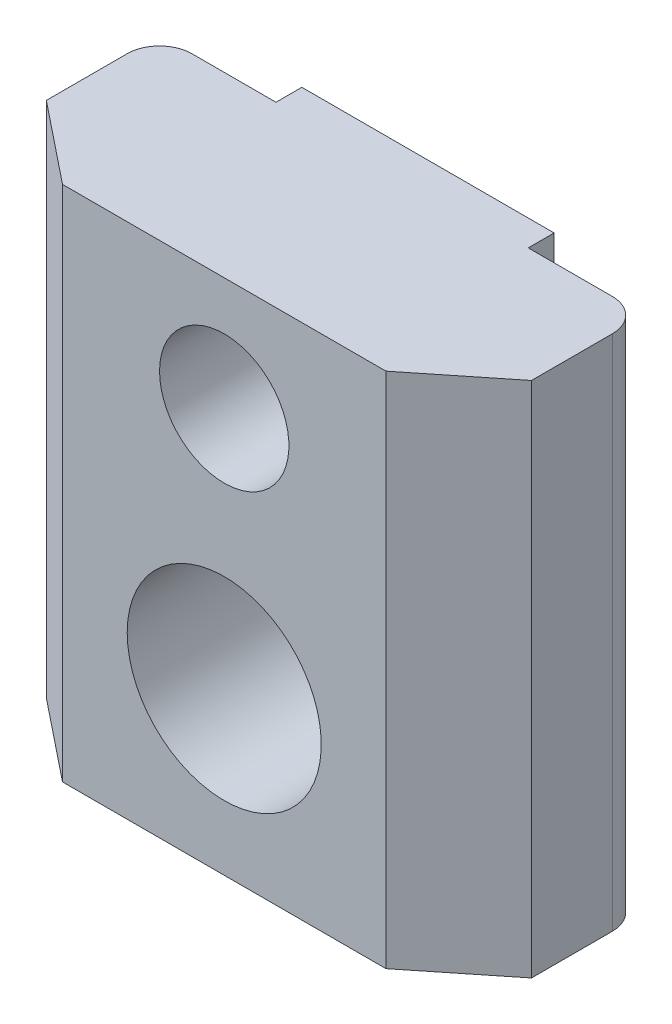
ISO-10303-21;
HEADER;
FILE_DESCRIPTION(('STEP AP214'),'2;1');
FILE_NAME('part.step','',(''),(''),'','','');
FILE_SCHEMA(('AUTOMOTIVE_DESIGN { 1 0 10303 214 1 1 1 1 }'));
ENDSEC;
DATA;
#1=APPLICATION_CONTEXT('core data for automotive mechanical design processes');
#2=APPLICATION_PROTOCOL_DEFINITION('international standard','automotive_design',2000,#1);
#3=PRODUCT_CONTEXT('',#1,'mechanical');
#4=PRODUCT('Part','Part','',(#3));
#5=PRODUCT_RELATED_PRODUCT_CATEGORY('part','',(#4));
#6=PRODUCT_DEFINITION_FORMATION('','',#4);
#7=PRODUCT_DEFINITION_CONTEXT('part definition',#1,'design');
#8=PRODUCT_DEFINITION('design','',#6,#7);
#9=PRODUCT_DEFINITION_SHAPE('','',#8);
#10=(LENGTH_UNIT() NAMED_UNIT(*) SI_UNIT(.MILLI.,.METRE.));
#11=(NAMED_UNIT(*) PLANE_ANGLE_UNIT() SI_UNIT($,.RADIAN.));
#12=(NAMED_UNIT(*) SI_UNIT($,.STERADIAN.) SOLID_ANGLE_UNIT());
#13=UNCERTAINTY_MEASURE_WITH_UNIT(LENGTH_MEASURE(1.E-05),#10,'distance_accuracy_value','');
#14=(GEOMETRIC_REPRESENTATION_CONTEXT(3) GLOBAL_UNCERTAINTY_ASSIGNED_CONTEXT((#13)) GLOBAL_UNIT_ASSIGNED_CONTEXT((#10,
#11,#12)) REPRESENTATION_CONTEXT('',''));
#15=CARTESIAN_POINT('',(0.,0.,0.));
#16=DIRECTION('',(0.,0.,1.));
#17=DIRECTION('',(1.,0.,0.));
#18=AXIS2_PLACEMENT_3D('',#15,#16,#17);
#19=CARTESIAN_POINT('',(3.9,-5.,-0.799999999999996));
#20=DIRECTION('',(1.,0.,0.));
#21=DIRECTION('',(0.,0.,-1.));
#22=AXIS2_PLACEMENT_3D('',#19,#20,#21);
#23=PLANE('',#22);
#24=DIRECTION('',(0.,1.,0.));
#25=VECTOR('',#24,1.);
#26=CARTESIAN_POINT('',(3.9,-5.,-0.799999999999996));
#27=LINE('',#26,#25);
#28=CARTESIAN_POINT('',(3.9,-5.,-0.799999999999996));
#29=VERTEX_POINT('',#28);
#30=CARTESIAN_POINT('',(3.9,11.,-0.799999999999996));
#31=VERTEX_POINT('',#30);
#32=EDGE_CURVE('E120',#29,#31,#27,.T.);
#33=ORIENTED_EDGE('',*,*,#32,.T.);
#34=DIRECTION('',(0.,0.,-1.));
#35=VECTOR('',#34,1.);
#36=CARTESIAN_POINT('',(3.9,11.,-0.799999999999996));
#37=LINE('',#36,#35);
#38=CARTESIAN_POINT('',(3.9,11.,0.));
#39=VERTEX_POINT('',#38);
#40=EDGE_CURVE('E124',#39,#31,#37,.T.);
#41=ORIENTED_EDGE('',*,*,#40,.F.);
#42=DIRECTION('',(0.,1.,0.));
#43=VECTOR('',#42,1.);
#44=CARTESIAN_POINT('',(3.9,-5.,0.));
#45=LINE('',#44,#43);
#46=CARTESIAN_POINT('',(3.9,-5.,0.));
#47=VERTEX_POINT('',#46);
#48=EDGE_CURVE('E194',#47,#39,#45,.T.);
#49=ORIENTED_EDGE('',*,*,#48,.F.);
#50=DIRECTION('',(0.,0.,-1.));
#51=VECTOR('',#50,1.);
#52=CARTESIAN_POINT('',(3.9,-5.,-0.799999999999996));
#53=LINE('',#52,#51);
#54=EDGE_CURVE('E126',#47,#29,#53,.T.);
#55=ORIENTED_EDGE('',*,*,#54,.T.);
#56=EDGE_LOOP('',(#33,#41,#49,#55));
#57=FACE_BOUND('',#56,.T.);
#58=ADVANCED_FACE('F31',(#57),#23,.T.);
#59=CARTESIAN_POINT('',(3.9,-5.,0.));
#60=DIRECTION('',(0.,0.,-1.));
#61=DIRECTION('',(-1.,0.,0.));
#62=AXIS2_PLACEMENT_3D('',#59,#60,#61);
#63=PLANE('',#62);
#64=DIRECTION('',(-1.,0.,0.));
#65=VECTOR('',#64,1.);
#66=CARTESIAN_POINT('',(3.9,11.,0.));
#67=LINE('',#66,#65);
#68=CARTESIAN_POINT('',(6.5,11.,0.));
#69=VERTEX_POINT('',#68);
#70=EDGE_CURVE('E144',#69,#39,#67,.T.);
#71=ORIENTED_EDGE('',*,*,#70,.F.);
#72=DIRECTION('',(0.,1.,0.));
#73=VECTOR('',#72,1.);
#74=CARTESIAN_POINT('',(6.5,-5.,0.));
#75=LINE('',#74,#73);
#76=CARTESIAN_POINT('',(6.5,-5.,0.));
#77=VERTEX_POINT('',#76);
#78=EDGE_CURVE('E215',#69,#77,#75,.F.);
#79=ORIENTED_EDGE('',*,*,#78,.T.);
#80=DIRECTION('',(-1.,0.,0.));
#81=VECTOR('',#80,1.);
#82=CARTESIAN_POINT('',(3.9,-5.,0.));
#83=LINE('',#82,#81);
#84=EDGE_CURVE('E131',#77,#47,#83,.T.);
#85=ORIENTED_EDGE('',*,*,#84,.T.);
#86=ORIENTED_EDGE('',*,*,#48,.T.);
#87=EDGE_LOOP('',(#71,#79,#85,#86));
#88=FACE_BOUND('',#87,.T.);
#89=ADVANCED_FACE('F260',(#88),#63,.T.);
#90=CARTESIAN_POINT('',(7.5,-5.,0.));
#91=DIRECTION('',(1.,0.,0.));
#92=DIRECTION('',(0.,0.,-1.));
#93=AXIS2_PLACEMENT_3D('',#90,#91,#92);
#94=PLANE('',#93);
#95=DIRECTION('',(0.,0.,-1.));
#96=VECTOR('',#95,1.);
#97=CARTESIAN_POINT('',(7.5,-5.,0.));
#98=LINE('',#97,#96);
#99=CARTESIAN_POINT('',(7.5,-5.,3.5));
#100=VERTEX_POINT('',#99);
#101=CARTESIAN_POINT('',(7.5,-5.,1.));
#102=VERTEX_POINT('',#101);
#103=EDGE_CURVE('E190',#100,#102,#98,.T.);
#104=ORIENTED_EDGE('',*,*,#103,.T.);
#105=DIRECTION('',(0.,1.,0.));
#106=VECTOR('',#105,1.);
#107=CARTESIAN_POINT('',(7.5,-5.,1.));
#108=LINE('',#107,#106);
#109=CARTESIAN_POINT('',(7.5,11.,1.));
#110=VERTEX_POINT('',#109);
#111=EDGE_CURVE('E196',#102,#110,#108,.T.);
#112=ORIENTED_EDGE('',*,*,#111,.T.);
#113=DIRECTION('',(0.,0.,-1.));
#114=VECTOR('',#113,1.);
#115=CARTESIAN_POINT('',(7.5,11.,0.));
#116=LINE('',#115,#114);
#117=CARTESIAN_POINT('',(7.5,11.,3.5));
#118=VERTEX_POINT('',#117);
#119=EDGE_CURVE('E168',#118,#110,#116,.T.);
#120=ORIENTED_EDGE('',*,*,#119,.F.);
#121=DIRECTION('',(0.,1.,0.));
#122=VECTOR('',#121,1.);
#123=CARTESIAN_POINT('',(7.5,-5.,3.5));
#124=LINE('',#123,#122);
#125=EDGE_CURVE('E197',#100,#118,#124,.T.);
#126=ORIENTED_EDGE('',*,*,#125,.F.);
#127=EDGE_LOOP('',(#104,#112,#120,#126));
#128=FACE_BOUND('',#127,.T.);
#129=ADVANCED_FACE('F239',(#128),#94,.T.);
#130=CARTESIAN_POINT('',(7.5,-5.,3.5));
#131=DIRECTION('',(0.624695047554424,0.,0.78086880944303));
#132=DIRECTION('',(0.78086880944303,0.,-0.624695047554424));
#133=AXIS2_PLACEMENT_3D('',#130,#131,#132);
#134=PLANE('',#133);
#135=ORIENTED_EDGE('',*,*,#125,.T.);
#136=DIRECTION('',(0.78086880944303,0.,-0.624695047554424));
#137=VECTOR('',#136,1.);
#138=CARTESIAN_POINT('',(7.5,11.,3.5));
#139=LINE('',#138,#137);
#140=CARTESIAN_POINT('',(5.,11.,5.5));
#141=VERTEX_POINT('',#140);
#142=EDGE_CURVE('E165',#141,#118,#139,.T.);
#143=ORIENTED_EDGE('',*,*,#142,.F.);
#144=DIRECTION('',(0.,1.,0.));
#145=VECTOR('',#144,1.);
#146=CARTESIAN_POINT('',(5.,-5.,5.5));
#147=LINE('',#146,#145);
#148=CARTESIAN_POINT('',(5.,-5.,5.5));
#149=VERTEX_POINT('',#148);
#150=EDGE_CURVE('E199',#149,#141,#147,.T.);
#151=ORIENTED_EDGE('',*,*,#150,.F.);
#152=DIRECTION('',(0.78086880944303,0.,-0.624695047554424));
#153=VECTOR('',#152,1.);
#154=CARTESIAN_POINT('',(7.5,-5.,3.5));
#155=LINE('',#154,#153);
#156=EDGE_CURVE('E187',#149,#100,#155,.T.);
#157=ORIENTED_EDGE('',*,*,#156,.T.);
#158=EDGE_LOOP('',(#135,#143,#151,#157));
#159=FACE_BOUND('',#158,.T.);
#160=ADVANCED_FACE('F243',(#159),#134,.T.);
#161=CARTESIAN_POINT('',(5.,-5.,5.5));
#162=DIRECTION('',(0.,0.,1.));
#163=DIRECTION('',(1.,0.,0.));
#164=AXIS2_PLACEMENT_3D('',#161,#162,#163);
#165=PLANE('',#164);
#166=CARTESIAN_POINT('',(0.,7.5,5.5));
#167=DIRECTION('',(0.,0.,-1.));
#168=DIRECTION('',(-1.,0.,0.));
#169=AXIS2_PLACEMENT_3D('',#166,#167,#168);
#170=CIRCLE('',#169,2.);
#171=CARTESIAN_POINT('',(-2.,7.5,5.5));
#172=VERTEX_POINT('',#171);
#173=EDGE_CURVE('E300',#172,#172,#170,.T.);
#174=ORIENTED_EDGE('',*,*,#173,.T.);
#175=EDGE_LOOP('',(#174));
#176=FACE_BOUND('',#175,.T.);
#177=CARTESIAN_POINT('',(0.,0.,5.5));
#178=DIRECTION('',(0.,0.,-1.));
#179=DIRECTION('',(-1.,0.,0.));
#180=AXIS2_PLACEMENT_3D('',#177,#178,#179);
#181=CIRCLE('',#180,3.);
#182=CARTESIAN_POINT('',(-3.,0.,5.5));
#183=VERTEX_POINT('',#182);
#184=EDGE_CURVE('E146',#183,#183,#181,.T.);
#185=ORIENTED_EDGE('',*,*,#184,.T.);
#186=EDGE_LOOP('',(#185));
#187=FACE_BOUND('',#186,.T.);
#188=ORIENTED_EDGE('',*,*,#150,.T.);
#189=DIRECTION('',(1.,0.,0.));
#190=VECTOR('',#189,1.);
#191=CARTESIAN_POINT('',(5.,11.,5.5));
#192=LINE('',#191,#190);
#193=CARTESIAN_POINT('',(-5.,11.,5.5));
#194=VERTEX_POINT('',#193);
#195=EDGE_CURVE('E162',#194,#141,#192,.T.);
#196=ORIENTED_EDGE('',*,*,#195,.F.);
#197=DIRECTION('',(0.,1.,0.));
#198=VECTOR('',#197,1.);
#199=CARTESIAN_POINT('',(-5.,-5.,5.5));
#200=LINE('',#199,#198);
#201=CARTESIAN_POINT('',(-5.,-5.,5.5));
#202=VERTEX_POINT('',#201);
#203=EDGE_CURVE('E201',#202,#194,#200,.T.);
#204=ORIENTED_EDGE('',*,*,#203,.F.);
#205=DIRECTION('',(1.,0.,0.));
#206=VECTOR('',#205,1.);
#207=CARTESIAN_POINT('',(5.,-5.,5.5));
#208=LINE('',#207,#206);
#209=EDGE_CURVE('E184',#202,#149,#208,.T.);
#210=ORIENTED_EDGE('',*,*,#209,.T.);
#211=EDGE_LOOP('',(#188,#196,#204,#210));
#212=FACE_BOUND('',#211,.T.);
#213=ADVANCED_FACE('F248',(#176,#187,#212),#165,.T.);
#214=CARTESIAN_POINT('',(-7.5,-5.,3.5));
#215=DIRECTION('',(-0.624695047554424,0.,0.78086880944303));
#216=DIRECTION('',(0.78086880944303,0.,0.624695047554424));
#217=AXIS2_PLACEMENT_3D('',#214,#215,#216);
#218=PLANE('',#217);
#219=ORIENTED_EDGE('',*,*,#203,.T.);
#220=DIRECTION('',(0.78086880944303,0.,0.624695047554424));
#221=VECTOR('',#220,1.);
#222=CARTESIAN_POINT('',(-7.5,11.,3.5));
#223=LINE('',#222,#221);
#224=CARTESIAN_POINT('',(-7.5,11.,3.5));
#225=VERTEX_POINT('',#224);
#226=EDGE_CURVE('E159',#225,#194,#223,.T.);
#227=ORIENTED_EDGE('',*,*,#226,.F.);
#228=DIRECTION('',(0.,1.,0.));
#229=VECTOR('',#228,1.);
#230=CARTESIAN_POINT('',(-7.5,-5.,3.5));
#231=LINE('',#230,#229);
#232=CARTESIAN_POINT('',(-7.5,-5.,3.5));
#233=VERTEX_POINT('',#232);
#234=EDGE_CURVE('E203',#233,#225,#231,.T.);
#235=ORIENTED_EDGE('',*,*,#234,.F.);
#236=DIRECTION('',(0.78086880944303,0.,0.624695047554424));
#237=VECTOR('',#236,1.);
#238=CARTESIAN_POINT('',(-7.5,-5.,3.5));
#239=LINE('',#238,#237);
#240=EDGE_CURVE('E181',#233,#202,#239,.T.);
#241=ORIENTED_EDGE('',*,*,#240,.T.);
#242=EDGE_LOOP('',(#219,#227,#235,#241));
#243=FACE_BOUND('',#242,.T.);
#244=ADVANCED_FACE('F251',(#243),#218,.T.);
#245=CARTESIAN_POINT('',(-7.5,-5.,0.));
#246=DIRECTION('',(-1.,0.,0.));
#247=DIRECTION('',(0.,0.,1.));
#248=AXIS2_PLACEMENT_3D('',#245,#246,#247);
#249=PLANE('',#248);
#250=DIRECTION('',(0.,0.,1.));
#251=VECTOR('',#250,1.);
#252=CARTESIAN_POINT('',(-7.5,11.,0.));
#253=LINE('',#252,#251);
#254=CARTESIAN_POINT('',(-7.5,11.,1.));
#255=VERTEX_POINT('',#254);
#256=EDGE_CURVE('E157',#255,#225,#253,.T.);
#257=ORIENTED_EDGE('',*,*,#256,.F.);
#258=DIRECTION('',(0.,1.,0.));
#259=VECTOR('',#258,1.);
#260=CARTESIAN_POINT('',(-7.5,-5.,1.));
#261=LINE('',#260,#259);
#262=CARTESIAN_POINT('',(-7.5,-5.,1.));
#263=VERTEX_POINT('',#262);
#264=EDGE_CURVE('E11',#255,#263,#261,.F.);
#265=ORIENTED_EDGE('',*,*,#264,.T.);
#266=DIRECTION('',(0.,0.,1.));
#267=VECTOR('',#266,1.);
#268=CARTESIAN_POINT('',(-7.5,-5.,0.));
#269=LINE('',#268,#267);
#270=EDGE_CURVE('E179',#263,#233,#269,.T.);
#271=ORIENTED_EDGE('',*,*,#270,.T.);
#272=ORIENTED_EDGE('',*,*,#234,.T.);
#273=EDGE_LOOP('',(#257,#265,#271,#272));
#274=FACE_BOUND('',#273,.T.);
#275=ADVANCED_FACE('F253',(#274),#249,.T.);
#276=CARTESIAN_POINT('',(-3.9,-5.,0.));
#277=DIRECTION('',(0.,0.,-1.));
#278=DIRECTION('',(-1.,0.,0.));
#279=AXIS2_PLACEMENT_3D('',#276,#277,#278);
#280=PLANE('',#279);
#281=DIRECTION('',(-1.,0.,0.));
#282=VECTOR('',#281,1.);
#283=CARTESIAN_POINT('',(-3.9,-5.,0.));
#284=LINE('',#283,#282);
#285=CARTESIAN_POINT('',(-3.9,-5.,0.));
#286=VERTEX_POINT('',#285);
#287=CARTESIAN_POINT('',(-6.5,-5.,0.));
#288=VERTEX_POINT('',#287);
#289=EDGE_CURVE('E177',#286,#288,#284,.T.);
#290=ORIENTED_EDGE('',*,*,#289,.T.);
#291=DIRECTION('',(0.,1.,0.));
#292=VECTOR('',#291,1.);
#293=CARTESIAN_POINT('',(-6.5,-5.,0.));
#294=LINE('',#293,#292);
#295=CARTESIAN_POINT('',(-6.5,11.,0.));
#296=VERTEX_POINT('',#295);
#297=EDGE_CURVE('E39',#288,#296,#294,.T.);
#298=ORIENTED_EDGE('',*,*,#297,.T.);
#299=DIRECTION('',(-1.,0.,0.));
#300=VECTOR('',#299,1.);
#301=CARTESIAN_POINT('',(-3.9,11.,0.));
#302=LINE('',#301,#300);
#303=CARTESIAN_POINT('',(-3.9,11.,0.));
#304=VERTEX_POINT('',#303);
#305=EDGE_CURVE('E154',#304,#296,#302,.T.);
#306=ORIENTED_EDGE('',*,*,#305,.F.);
#307=DIRECTION('',(0.,1.,0.));
#308=VECTOR('',#307,1.);
#309=CARTESIAN_POINT('',(-3.9,-5.,0.));
#310=LINE('',#309,#308);
#311=EDGE_CURVE('E206',#286,#304,#310,.T.);
#312=ORIENTED_EDGE('',*,*,#311,.F.);
#313=EDGE_LOOP('',(#290,#298,#306,#312));
#314=FACE_BOUND('',#313,.T.);
#315=ADVANCED_FACE('F223',(#314),#280,.T.);
#316=CARTESIAN_POINT('',(-3.9,-5.,-0.799999999999996));
#317=DIRECTION('',(-1.,0.,0.));
#318=DIRECTION('',(0.,0.,1.));
#319=AXIS2_PLACEMENT_3D('',#316,#317,#318);
#320=PLANE('',#319);
#321=ORIENTED_EDGE('',*,*,#311,.T.);
#322=DIRECTION('',(0.,0.,1.));
#323=VECTOR('',#322,1.);
#324=CARTESIAN_POINT('',(-3.9,11.,-0.799999999999996));
#325=LINE('',#324,#323);
#326=CARTESIAN_POINT('',(-3.9,11.,-0.799999999999996));
#327=VERTEX_POINT('',#326);
#328=EDGE_CURVE('E139',#327,#304,#325,.T.);
#329=ORIENTED_EDGE('',*,*,#328,.F.);
#330=DIRECTION('',(0.,1.,0.));
#331=VECTOR('',#330,1.);
#332=CARTESIAN_POINT('',(-3.9,-5.,-0.799999999999996));
#333=LINE('',#332,#331);
#334=CARTESIAN_POINT('',(-3.9,-5.,-0.799999999999996));
#335=VERTEX_POINT('',#334);
#336=EDGE_CURVE('E130',#335,#327,#333,.T.);
#337=ORIENTED_EDGE('',*,*,#336,.F.);
#338=DIRECTION('',(0.,0.,1.));
#339=VECTOR('',#338,1.);
#340=CARTESIAN_POINT('',(-3.9,-5.,-0.799999999999996));
#341=LINE('',#340,#339);
#342=EDGE_CURVE('E174',#335,#286,#341,.T.);
#343=ORIENTED_EDGE('',*,*,#342,.T.);
#344=EDGE_LOOP('',(#321,#329,#337,#343));
#345=FACE_BOUND('',#344,.T.);
#346=ADVANCED_FACE('F226',(#345),#320,.T.);
#347=CARTESIAN_POINT('',(-3.9,-5.,-0.799999999999996));
#348=DIRECTION('',(0.,0.,-1.));
#349=DIRECTION('',(-1.,0.,0.));
#350=AXIS2_PLACEMENT_3D('',#347,#348,#349);
#351=PLANE('',#350);
#352=CARTESIAN_POINT('',(0.,7.5,-0.799999999999996));
#353=DIRECTION('',(0.,0.,-1.));
#354=DIRECTION('',(-1.,0.,0.));
#355=AXIS2_PLACEMENT_3D('',#352,#353,#354);
#356=CIRCLE('',#355,2.);
#357=CARTESIAN_POINT('',(-2.,7.5,-0.799999999999996));
#358=VERTEX_POINT('',#357);
#359=EDGE_CURVE('E303',#358,#358,#356,.T.);
#360=ORIENTED_EDGE('',*,*,#359,.F.);
#361=EDGE_LOOP('',(#360));
#362=FACE_BOUND('',#361,.T.);
#363=CARTESIAN_POINT('',(0.,0.,-0.799999999999996));
#364=DIRECTION('',(0.,0.,-1.));
#365=DIRECTION('',(-1.,0.,0.));
#366=AXIS2_PLACEMENT_3D('',#363,#364,#365);
#367=CIRCLE('',#366,3.);
#368=CARTESIAN_POINT('',(-3.,0.,-0.799999999999996));
#369=VERTEX_POINT('',#368);
#370=EDGE_CURVE('E149',#369,#369,#367,.T.);
#371=ORIENTED_EDGE('',*,*,#370,.F.);
#372=EDGE_LOOP('',(#371));
#373=FACE_BOUND('',#372,.T.);
#374=ORIENTED_EDGE('',*,*,#336,.T.);
#375=DIRECTION('',(-1.,0.,0.));
#376=VECTOR('',#375,1.);
#377=CARTESIAN_POINT('',(-3.9,11.,-0.799999999999996));
#378=LINE('',#377,#376);
#379=EDGE_CURVE('E134',#31,#327,#378,.T.);
#380=ORIENTED_EDGE('',*,*,#379,.F.);
#381=ORIENTED_EDGE('',*,*,#32,.F.);
#382=DIRECTION('',(-1.,0.,0.));
#383=VECTOR('',#382,1.);
#384=CARTESIAN_POINT('',(-3.9,-5.,-0.799999999999996));
#385=LINE('',#384,#383);
#386=EDGE_CURVE('E172',#29,#335,#385,.T.);
#387=ORIENTED_EDGE('',*,*,#386,.T.);
#388=EDGE_LOOP('',(#374,#380,#381,#387));
#389=FACE_BOUND('',#388,.T.);
#390=ADVANCED_FACE('F135',(#362,#373,#389),#351,.T.);
#391=CARTESIAN_POINT('',(3.9,-5.,0.));
#392=DIRECTION('',(0.,1.,0.));
#393=DIRECTION('',(0.,0.,1.));
#394=AXIS2_PLACEMENT_3D('',#391,#392,#393);
#395=PLANE('',#394);
#396=ORIENTED_EDGE('',*,*,#84,.F.);
#397=CARTESIAN_POINT('',(6.5,-5.,1.));
#398=DIRECTION('',(0.,1.,0.));
#399=DIRECTION('',(0.,0.,1.));
#400=AXIS2_PLACEMENT_3D('',#397,#398,#399);
#401=CIRCLE('',#400,1.);
#402=EDGE_CURVE('E218',#77,#102,#401,.F.);
#403=ORIENTED_EDGE('',*,*,#402,.T.);
#404=ORIENTED_EDGE('',*,*,#103,.F.);
#405=ORIENTED_EDGE('',*,*,#156,.F.);
#406=ORIENTED_EDGE('',*,*,#209,.F.);
#407=ORIENTED_EDGE('',*,*,#240,.F.);
#408=ORIENTED_EDGE('',*,*,#270,.F.);
#409=CARTESIAN_POINT('',(-6.5,-5.,1.));
#410=DIRECTION('',(0.,1.,0.));
#411=DIRECTION('',(0.,0.,1.));
#412=AXIS2_PLACEMENT_3D('',#409,#410,#411);
#413=CIRCLE('',#412,1.);
#414=EDGE_CURVE('E46',#263,#288,#413,.F.);
#415=ORIENTED_EDGE('',*,*,#414,.T.);
#416=ORIENTED_EDGE('',*,*,#289,.F.);
#417=ORIENTED_EDGE('',*,*,#342,.F.);
#418=ORIENTED_EDGE('',*,*,#386,.F.);
#419=ORIENTED_EDGE('',*,*,#54,.F.);
#420=EDGE_LOOP('',(#396,#403,#404,#405,#406,#407,#408,#415,#416,#417,#418,#419));
#421=FACE_BOUND('',#420,.T.);
#422=ADVANCED_FACE('F229',(#421),#395,.F.);
#423=CARTESIAN_POINT('',(3.9,11.,0.));
#424=DIRECTION('',(0.,1.,0.));
#425=DIRECTION('',(0.,0.,1.));
#426=AXIS2_PLACEMENT_3D('',#423,#424,#425);
#427=PLANE('',#426);
#428=ORIENTED_EDGE('',*,*,#119,.T.);
#429=CARTESIAN_POINT('',(6.5,11.,1.));
#430=DIRECTION('',(0.,1.,0.));
#431=DIRECTION('',(0.,0.,1.));
#432=AXIS2_PLACEMENT_3D('',#429,#430,#431);
#433=CIRCLE('',#432,1.);
#434=EDGE_CURVE('E213',#110,#69,#433,.T.);
#435=ORIENTED_EDGE('',*,*,#434,.T.);
#436=ORIENTED_EDGE('',*,*,#70,.T.);
#437=ORIENTED_EDGE('',*,*,#40,.T.);
#438=ORIENTED_EDGE('',*,*,#379,.T.);
#439=ORIENTED_EDGE('',*,*,#328,.T.);
#440=ORIENTED_EDGE('',*,*,#305,.T.);
#441=CARTESIAN_POINT('',(-6.5,11.,1.));
#442=DIRECTION('',(0.,1.,0.));
#443=DIRECTION('',(0.,0.,1.));
#444=AXIS2_PLACEMENT_3D('',#441,#442,#443);
#445=CIRCLE('',#444,1.);
#446=EDGE_CURVE('E211',#296,#255,#445,.T.);
#447=ORIENTED_EDGE('',*,*,#446,.T.);
#448=ORIENTED_EDGE('',*,*,#256,.T.);
#449=ORIENTED_EDGE('',*,*,#226,.T.);
#450=ORIENTED_EDGE('',*,*,#195,.T.);
#451=ORIENTED_EDGE('',*,*,#142,.T.);
#452=EDGE_LOOP('',(#428,#435,#436,#437,#438,#439,#440,#447,#448,#449,#450,#451));
#453=FACE_BOUND('',#452,.T.);
#454=ADVANCED_FACE('F142',(#453),#427,.T.);
#455=CARTESIAN_POINT('',(0.,0.,5.5));
#456=DIRECTION('',(0.,0.,-1.));
#457=DIRECTION('',(-1.,0.,0.));
#458=AXIS2_PLACEMENT_3D('',#455,#456,#457);
#459=CYLINDRICAL_SURFACE('',#458,3.);
#460=ORIENTED_EDGE('',*,*,#184,.F.);
#461=EDGE_LOOP('',(#460));
#462=FACE_BOUND('',#461,.T.);
#463=ORIENTED_EDGE('',*,*,#370,.T.);
#464=EDGE_LOOP('',(#463));
#465=FACE_BOUND('',#464,.T.);
#466=ADVANCED_FACE('F289',(#462,#465),#459,.F.);
#467=CARTESIAN_POINT('',(0.,7.5,5.5));
#468=DIRECTION('',(0.,0.,-1.));
#469=DIRECTION('',(-1.,0.,0.));
#470=AXIS2_PLACEMENT_3D('',#467,#468,#469);
#471=CYLINDRICAL_SURFACE('',#470,2.);
#472=ORIENTED_EDGE('',*,*,#173,.F.);
#473=EDGE_LOOP('',(#472));
#474=FACE_BOUND('',#473,.T.);
#475=ORIENTED_EDGE('',*,*,#359,.T.);
#476=EDGE_LOOP('',(#475));
#477=FACE_BOUND('',#476,.T.);
#478=ADVANCED_FACE('F258',(#474,#477),#471,.F.);
#479=CARTESIAN_POINT('',(6.5,-5.,1.));
#480=DIRECTION('',(0.,1.,0.));
#481=DIRECTION('',(0.,0.,1.));
#482=AXIS2_PLACEMENT_3D('',#479,#480,#481);
#483=CYLINDRICAL_SURFACE('',#482,1.);
#484=ORIENTED_EDGE('',*,*,#402,.F.);
#485=ORIENTED_EDGE('',*,*,#78,.F.);
#486=ORIENTED_EDGE('',*,*,#434,.F.);
#487=ORIENTED_EDGE('',*,*,#111,.F.);
#488=EDGE_LOOP('',(#484,#485,#486,#487));
#489=FACE_BOUND('',#488,.T.);
#490=ADVANCED_FACE('F236',(#489),#483,.T.);
#491=CARTESIAN_POINT('',(-6.5,-5.,1.));
#492=DIRECTION('',(0.,1.,0.));
#493=DIRECTION('',(0.,0.,1.));
#494=AXIS2_PLACEMENT_3D('',#491,#492,#493);
#495=CYLINDRICAL_SURFACE('',#494,1.);
#496=ORIENTED_EDGE('',*,*,#414,.F.);
#497=ORIENTED_EDGE('',*,*,#264,.F.);
#498=ORIENTED_EDGE('',*,*,#446,.F.);
#499=ORIENTED_EDGE('',*,*,#297,.F.);
#500=EDGE_LOOP('',(#496,#497,#498,#499));
#501=FACE_BOUND('',#500,.T.);
#502=ADVANCED_FACE('F33',(#501),#495,.T.);
#503=CLOSED_SHELL('',(#58,#89,#129,#160,#213,#244,#275,#315,#346,#390,#422,#454,#466,#478,#490,#502));
#504=MANIFOLD_SOLID_BREP('B2',#503);
#505=ADVANCED_BREP_SHAPE_REPRESENTATION('',(#18,#504),#14);
#506=SHAPE_DEFINITION_REPRESENTATION(#9,#505);
ENDSEC;
END-ISO-10303-21;
